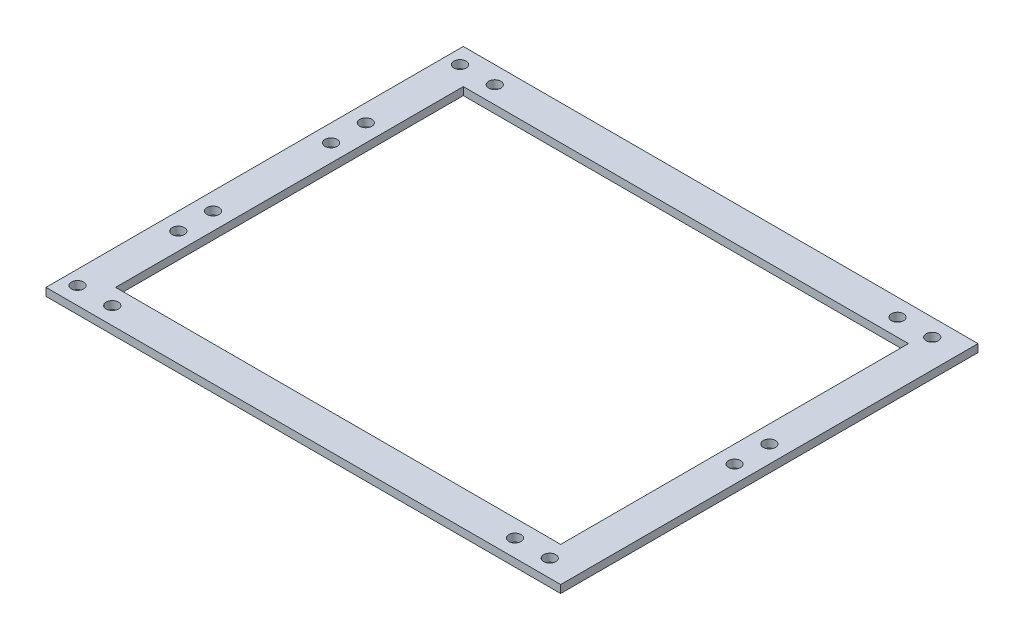
ISO-10303-21;
HEADER;
FILE_DESCRIPTION(('STEP AP214'),'2;1');
FILE_NAME('part.step','',(''),(''),'','','');
FILE_SCHEMA(('AUTOMOTIVE_DESIGN { 1 0 10303 214 1 1 1 1 }'));
ENDSEC;
DATA;
#1=APPLICATION_CONTEXT('core data for automotive mechanical design processes');
#2=APPLICATION_PROTOCOL_DEFINITION('international standard','automotive_design',2000,#1);
#3=PRODUCT_CONTEXT('',#1,'mechanical');
#4=PRODUCT('Part','Part','',(#3));
#5=PRODUCT_RELATED_PRODUCT_CATEGORY('part','',(#4));
#6=PRODUCT_DEFINITION_FORMATION('','',#4);
#7=PRODUCT_DEFINITION_CONTEXT('part definition',#1,'design');
#8=PRODUCT_DEFINITION('design','',#6,#7);
#9=PRODUCT_DEFINITION_SHAPE('','',#8);
#10=(LENGTH_UNIT() NAMED_UNIT(*) SI_UNIT(.MILLI.,.METRE.));
#11=(NAMED_UNIT(*) PLANE_ANGLE_UNIT() SI_UNIT($,.RADIAN.));
#12=(NAMED_UNIT(*) SI_UNIT($,.STERADIAN.) SOLID_ANGLE_UNIT());
#13=UNCERTAINTY_MEASURE_WITH_UNIT(LENGTH_MEASURE(1.E-05),#10,'distance_accuracy_value','');
#14=(GEOMETRIC_REPRESENTATION_CONTEXT(3) GLOBAL_UNCERTAINTY_ASSIGNED_CONTEXT((#13)) GLOBAL_UNIT_ASSIGNED_CONTEXT((#10,
#11,#12)) REPRESENTATION_CONTEXT('',''));
#15=CARTESIAN_POINT('',(0.,0.,0.));
#16=DIRECTION('',(0.,0.,1.));
#17=DIRECTION('',(1.,0.,0.));
#18=AXIS2_PLACEMENT_3D('',#15,#16,#17);
#19=CARTESIAN_POINT('',(0.,4.5,0.));
#20=DIRECTION('',(0.,-1.,0.));
#21=DIRECTION('',(0.,0.,-1.));
#22=AXIS2_PLACEMENT_3D('',#19,#20,#21);
#23=PLANE('',#22);
#24=CARTESIAN_POINT('',(-138.,4.5,-53.9240434819204));
#25=DIRECTION('',(0.,1.,0.));
#26=DIRECTION('',(0.,0.,1.));
#27=AXIS2_PLACEMENT_3D('',#24,#25,#26);
#28=CIRCLE('',#27,3.49999999999999);
#29=CARTESIAN_POINT('',(-138.,4.5,-50.4240434819204));
#30=VERTEX_POINT('',#29);
#31=EDGE_CURVE('E308',#30,#30,#28,.T.);
#32=ORIENTED_EDGE('',*,*,#31,.F.);
#33=EDGE_LOOP('',(#32));
#34=FACE_BOUND('',#33,.T.);
#35=CARTESIAN_POINT('',(-138.,4.5,-33.9240434819204));
#36=DIRECTION('',(0.,1.,0.));
#37=DIRECTION('',(0.,0.,1.));
#38=AXIS2_PLACEMENT_3D('',#35,#36,#37);
#39=CIRCLE('',#38,3.49999999999999);
#40=CARTESIAN_POINT('',(-138.,4.5,-30.4240434819204));
#41=VERTEX_POINT('',#40);
#42=EDGE_CURVE('E317',#41,#41,#39,.T.);
#43=ORIENTED_EDGE('',*,*,#42,.F.);
#44=EDGE_LOOP('',(#43));
#45=FACE_BOUND('',#44,.T.);
#46=CARTESIAN_POINT('',(-138.,4.5,33.9240434819206));
#47=DIRECTION('',(0.,1.,0.));
#48=DIRECTION('',(0.,0.,1.));
#49=AXIS2_PLACEMENT_3D('',#46,#47,#48);
#50=CIRCLE('',#49,3.49999999999999);
#51=CARTESIAN_POINT('',(-138.,4.5,37.4240434819206));
#52=VERTEX_POINT('',#51);
#53=EDGE_CURVE('E327',#52,#52,#50,.T.);
#54=ORIENTED_EDGE('',*,*,#53,.F.);
#55=EDGE_LOOP('',(#54));
#56=FACE_BOUND('',#55,.T.);
#57=CARTESIAN_POINT('',(-138.,4.5,53.9240434819206));
#58=DIRECTION('',(0.,1.,0.));
#59=DIRECTION('',(0.,0.,1.));
#60=AXIS2_PLACEMENT_3D('',#57,#58,#59);
#61=CIRCLE('',#60,3.49999999999999);
#62=CARTESIAN_POINT('',(-138.,4.5,57.4240434819206));
#63=VERTEX_POINT('',#62);
#64=EDGE_CURVE('E335',#63,#63,#61,.T.);
#65=ORIENTED_EDGE('',*,*,#64,.F.);
#66=EDGE_LOOP('',(#65));
#67=FACE_BOUND('',#66,.T.);
#68=CARTESIAN_POINT('',(138.,4.5,10.));
#69=DIRECTION('',(0.,1.,0.));
#70=DIRECTION('',(0.,0.,1.));
#71=AXIS2_PLACEMENT_3D('',#68,#69,#70);
#72=CIRCLE('',#71,3.49999999999999);
#73=CARTESIAN_POINT('',(138.,4.5,13.5));
#74=VERTEX_POINT('',#73);
#75=EDGE_CURVE('E344',#74,#74,#72,.T.);
#76=ORIENTED_EDGE('',*,*,#75,.F.);
#77=EDGE_LOOP('',(#76));
#78=FACE_BOUND('',#77,.T.);
#79=CARTESIAN_POINT('',(138.,4.5,-10.));
#80=DIRECTION('',(0.,1.,0.));
#81=DIRECTION('',(0.,0.,1.));
#82=AXIS2_PLACEMENT_3D('',#79,#80,#81);
#83=CIRCLE('',#82,3.49999999999999);
#84=CARTESIAN_POINT('',(138.,4.5,-6.50000000000002));
#85=VERTEX_POINT('',#84);
#86=EDGE_CURVE('E314',#85,#85,#83,.T.);
#87=ORIENTED_EDGE('',*,*,#86,.F.);
#88=EDGE_LOOP('',(#87));
#89=FACE_BOUND('',#88,.T.);
#90=CARTESIAN_POINT('',(111.7,4.5,-110.));
#91=DIRECTION('',(0.,-1.,0.));
#92=DIRECTION('',(0.,0.,-1.));
#93=AXIS2_PLACEMENT_3D('',#90,#91,#92);
#94=CIRCLE('',#93,3.50000000000001);
#95=CARTESIAN_POINT('',(111.7,4.5,-113.5));
#96=VERTEX_POINT('',#95);
#97=EDGE_CURVE('E360',#96,#96,#94,.T.);
#98=ORIENTED_EDGE('',*,*,#97,.T.);
#99=EDGE_LOOP('',(#98));
#100=FACE_BOUND('',#99,.T.);
#101=CARTESIAN_POINT('',(131.7,4.5,-110.));
#102=DIRECTION('',(0.,-1.,0.));
#103=DIRECTION('',(0.,0.,-1.));
#104=AXIS2_PLACEMENT_3D('',#101,#102,#103);
#105=CIRCLE('',#104,3.49999999999999);
#106=CARTESIAN_POINT('',(131.7,4.5,-113.5));
#107=VERTEX_POINT('',#106);
#108=EDGE_CURVE('E343',#107,#107,#105,.T.);
#109=ORIENTED_EDGE('',*,*,#108,.T.);
#110=EDGE_LOOP('',(#109));
#111=FACE_BOUND('',#110,.T.);
#112=CARTESIAN_POINT('',(111.7,4.5,110.));
#113=DIRECTION('',(0.,1.,0.));
#114=DIRECTION('',(0.,0.,1.));
#115=AXIS2_PLACEMENT_3D('',#112,#113,#114);
#116=CIRCLE('',#115,3.50000000000001);
#117=CARTESIAN_POINT('',(111.7,4.5,113.5));
#118=VERTEX_POINT('',#117);
#119=EDGE_CURVE('E376',#118,#118,#116,.T.);
#120=ORIENTED_EDGE('',*,*,#119,.F.);
#121=EDGE_LOOP('',(#120));
#122=FACE_BOUND('',#121,.T.);
#123=CARTESIAN_POINT('',(131.7,4.5,110.));
#124=DIRECTION('',(0.,1.,0.));
#125=DIRECTION('',(0.,0.,1.));
#126=AXIS2_PLACEMENT_3D('',#123,#124,#125);
#127=CIRCLE('',#126,3.49999999999999);
#128=CARTESIAN_POINT('',(131.7,4.5,113.5));
#129=VERTEX_POINT('',#128);
#130=EDGE_CURVE('E359',#129,#129,#127,.T.);
#131=ORIENTED_EDGE('',*,*,#130,.F.);
#132=EDGE_LOOP('',(#131));
#133=FACE_BOUND('',#132,.T.);
#134=CARTESIAN_POINT('',(-139.9,4.5,-110.));
#135=DIRECTION('',(0.,-1.,0.));
#136=DIRECTION('',(0.,0.,-1.));
#137=AXIS2_PLACEMENT_3D('',#134,#135,#136);
#138=CIRCLE('',#137,3.49999999999999);
#139=CARTESIAN_POINT('',(-139.9,4.5,-113.5));
#140=VERTEX_POINT('',#139);
#141=EDGE_CURVE('E392',#140,#140,#138,.T.);
#142=ORIENTED_EDGE('',*,*,#141,.T.);
#143=EDGE_LOOP('',(#142));
#144=FACE_BOUND('',#143,.T.);
#145=CARTESIAN_POINT('',(-119.9,4.5,-110.));
#146=DIRECTION('',(0.,-1.,0.));
#147=DIRECTION('',(0.,0.,-1.));
#148=AXIS2_PLACEMENT_3D('',#145,#146,#147);
#149=CIRCLE('',#148,3.50000000000001);
#150=CARTESIAN_POINT('',(-119.9,4.5,-113.5));
#151=VERTEX_POINT('',#150);
#152=EDGE_CURVE('E375',#151,#151,#149,.T.);
#153=ORIENTED_EDGE('',*,*,#152,.T.);
#154=EDGE_LOOP('',(#153));
#155=FACE_BOUND('',#154,.T.);
#156=CARTESIAN_POINT('',(-139.9,4.5,110.));
#157=DIRECTION('',(0.,1.,0.));
#158=DIRECTION('',(0.,0.,1.));
#159=AXIS2_PLACEMENT_3D('',#156,#157,#158);
#160=CIRCLE('',#159,3.49999999999999);
#161=CARTESIAN_POINT('',(-139.9,4.5,113.5));
#162=VERTEX_POINT('',#161);
#163=EDGE_CURVE('E406',#162,#162,#160,.T.);
#164=ORIENTED_EDGE('',*,*,#163,.F.);
#165=EDGE_LOOP('',(#164));
#166=FACE_BOUND('',#165,.T.);
#167=CARTESIAN_POINT('',(-119.9,4.5,110.));
#168=DIRECTION('',(0.,1.,0.));
#169=DIRECTION('',(0.,0.,1.));
#170=AXIS2_PLACEMENT_3D('',#167,#168,#169);
#171=CIRCLE('',#170,3.50000000000001);
#172=CARTESIAN_POINT('',(-119.9,4.5,113.5));
#173=VERTEX_POINT('',#172);
#174=EDGE_CURVE('E391',#173,#173,#171,.T.);
#175=ORIENTED_EDGE('',*,*,#174,.F.);
#176=EDGE_LOOP('',(#175));
#177=FACE_BOUND('',#176,.T.);
#178=DIRECTION('',(0.,0.,-1.));
#179=VECTOR('',#178,1.);
#180=CARTESIAN_POINT('',(148.,4.5,120.));
#181=LINE('',#180,#179);
#182=CARTESIAN_POINT('',(148.,4.5,120.));
#183=VERTEX_POINT('',#182);
#184=CARTESIAN_POINT('',(148.,4.5,-120.));
#185=VERTEX_POINT('',#184);
#186=EDGE_CURVE('E154',#183,#185,#181,.T.);
#187=ORIENTED_EDGE('',*,*,#186,.T.);
#188=DIRECTION('',(-1.,0.,0.));
#189=VECTOR('',#188,1.);
#190=CARTESIAN_POINT('',(-148.,4.5,-120.));
#191=LINE('',#190,#189);
#192=CARTESIAN_POINT('',(-148.,4.5,-120.));
#193=VERTEX_POINT('',#192);
#194=EDGE_CURVE('E158',#185,#193,#191,.T.);
#195=ORIENTED_EDGE('',*,*,#194,.T.);
#196=DIRECTION('',(0.,0.,1.));
#197=VECTOR('',#196,1.);
#198=CARTESIAN_POINT('',(-148.,4.5,120.));
#199=LINE('',#198,#197);
#200=CARTESIAN_POINT('',(-148.,4.5,120.));
#201=VERTEX_POINT('',#200);
#202=EDGE_CURVE('E162',#193,#201,#199,.T.);
#203=ORIENTED_EDGE('',*,*,#202,.T.);
#204=DIRECTION('',(1.,0.,0.));
#205=VECTOR('',#204,1.);
#206=CARTESIAN_POINT('',(-148.,4.5,120.));
#207=LINE('',#206,#205);
#208=EDGE_CURVE('E165',#201,#183,#207,.T.);
#209=ORIENTED_EDGE('',*,*,#208,.T.);
#210=EDGE_LOOP('',(#187,#195,#203,#209));
#211=FACE_BOUND('',#210,.T.);
#212=DIRECTION('',(0.,0.,1.));
#213=VECTOR('',#212,1.);
#214=CARTESIAN_POINT('',(-128.,4.5,-100.));
#215=LINE('',#214,#213);
#216=CARTESIAN_POINT('',(-128.,4.5,-100.));
#217=VERTEX_POINT('',#216);
#218=CARTESIAN_POINT('',(-128.,4.5,100.));
#219=VERTEX_POINT('',#218);
#220=EDGE_CURVE('E104',#217,#219,#215,.T.);
#221=ORIENTED_EDGE('',*,*,#220,.F.);
#222=DIRECTION('',(-1.,0.,0.));
#223=VECTOR('',#222,1.);
#224=CARTESIAN_POINT('',(-128.,4.5,-100.));
#225=LINE('',#224,#223);
#226=CARTESIAN_POINT('',(128.,4.5,-100.));
#227=VERTEX_POINT('',#226);
#228=EDGE_CURVE('E130',#227,#217,#225,.T.);
#229=ORIENTED_EDGE('',*,*,#228,.F.);
#230=DIRECTION('',(0.,0.,-1.));
#231=VECTOR('',#230,1.);
#232=CARTESIAN_POINT('',(128.,4.5,-100.));
#233=LINE('',#232,#231);
#234=CARTESIAN_POINT('',(128.,4.5,100.));
#235=VERTEX_POINT('',#234);
#236=EDGE_CURVE('E126',#235,#227,#233,.T.);
#237=ORIENTED_EDGE('',*,*,#236,.F.);
#238=DIRECTION('',(1.,0.,0.));
#239=VECTOR('',#238,1.);
#240=CARTESIAN_POINT('',(-128.,4.5,100.));
#241=LINE('',#240,#239);
#242=EDGE_CURVE('E113',#219,#235,#241,.T.);
#243=ORIENTED_EDGE('',*,*,#242,.F.);
#244=EDGE_LOOP('',(#221,#229,#237,#243));
#245=FACE_BOUND('',#244,.T.);
#246=ADVANCED_FACE('F38',(#34,#45,#56,#67,#78,#89,#100,#111,#122,#133,#144,#155,#166,#177,#211,
#245),#23,.F.);
#247=CARTESIAN_POINT('',(0.,0.,0.));
#248=DIRECTION('',(0.,-1.,0.));
#249=DIRECTION('',(0.,0.,-1.));
#250=AXIS2_PLACEMENT_3D('',#247,#248,#249);
#251=PLANE('',#250);
#252=CARTESIAN_POINT('',(-138.,0.,-53.9240434819204));
#253=DIRECTION('',(0.,1.,0.));
#254=DIRECTION('',(0.,0.,1.));
#255=AXIS2_PLACEMENT_3D('',#252,#253,#254);
#256=CIRCLE('',#255,3.49999999999999);
#257=CARTESIAN_POINT('',(-138.,0.,-50.4240434819204));
#258=VERTEX_POINT('',#257);
#259=EDGE_CURVE('E306',#258,#258,#256,.T.);
#260=ORIENTED_EDGE('',*,*,#259,.T.);
#261=EDGE_LOOP('',(#260));
#262=FACE_BOUND('',#261,.T.);
#263=CARTESIAN_POINT('',(-138.,0.,-33.9240434819204));
#264=DIRECTION('',(0.,1.,0.));
#265=DIRECTION('',(0.,0.,1.));
#266=AXIS2_PLACEMENT_3D('',#263,#264,#265);
#267=CIRCLE('',#266,3.49999999999999);
#268=CARTESIAN_POINT('',(-138.,0.,-30.4240434819204));
#269=VERTEX_POINT('',#268);
#270=EDGE_CURVE('E310',#269,#269,#267,.T.);
#271=ORIENTED_EDGE('',*,*,#270,.T.);
#272=EDGE_LOOP('',(#271));
#273=FACE_BOUND('',#272,.T.);
#274=CARTESIAN_POINT('',(-138.,0.,33.9240434819206));
#275=DIRECTION('',(0.,1.,0.));
#276=DIRECTION('',(0.,0.,1.));
#277=AXIS2_PLACEMENT_3D('',#274,#275,#276);
#278=CIRCLE('',#277,3.49999999999999);
#279=CARTESIAN_POINT('',(-138.,0.,37.4240434819206));
#280=VERTEX_POINT('',#279);
#281=EDGE_CURVE('E323',#280,#280,#278,.T.);
#282=ORIENTED_EDGE('',*,*,#281,.T.);
#283=EDGE_LOOP('',(#282));
#284=FACE_BOUND('',#283,.T.);
#285=CARTESIAN_POINT('',(-138.,0.,53.9240434819206));
#286=DIRECTION('',(0.,1.,0.));
#287=DIRECTION('',(0.,0.,1.));
#288=AXIS2_PLACEMENT_3D('',#285,#286,#287);
#289=CIRCLE('',#288,3.49999999999999);
#290=CARTESIAN_POINT('',(-138.,0.,57.4240434819206));
#291=VERTEX_POINT('',#290);
#292=EDGE_CURVE('E331',#291,#291,#289,.T.);
#293=ORIENTED_EDGE('',*,*,#292,.T.);
#294=EDGE_LOOP('',(#293));
#295=FACE_BOUND('',#294,.T.);
#296=CARTESIAN_POINT('',(138.,0.,10.));
#297=DIRECTION('',(0.,1.,0.));
#298=DIRECTION('',(0.,0.,1.));
#299=AXIS2_PLACEMENT_3D('',#296,#297,#298);
#300=CIRCLE('',#299,3.49999999999999);
#301=CARTESIAN_POINT('',(138.,0.,13.5));
#302=VERTEX_POINT('',#301);
#303=EDGE_CURVE('E339',#302,#302,#300,.T.);
#304=ORIENTED_EDGE('',*,*,#303,.T.);
#305=EDGE_LOOP('',(#304));
#306=FACE_BOUND('',#305,.T.);
#307=CARTESIAN_POINT('',(138.,0.,-10.));
#308=DIRECTION('',(0.,1.,0.));
#309=DIRECTION('',(0.,0.,1.));
#310=AXIS2_PLACEMENT_3D('',#307,#308,#309);
#311=CIRCLE('',#310,3.49999999999999);
#312=CARTESIAN_POINT('',(138.,0.,-6.50000000000002));
#313=VERTEX_POINT('',#312);
#314=EDGE_CURVE('E348',#313,#313,#311,.T.);
#315=ORIENTED_EDGE('',*,*,#314,.T.);
#316=EDGE_LOOP('',(#315));
#317=FACE_BOUND('',#316,.T.);
#318=CARTESIAN_POINT('',(111.7,0.,-110.));
#319=DIRECTION('',(0.,-1.,0.));
#320=DIRECTION('',(0.,0.,-1.));
#321=AXIS2_PLACEMENT_3D('',#318,#319,#320);
#322=CIRCLE('',#321,3.50000000000001);
#323=CARTESIAN_POINT('',(111.7,0.,-113.5));
#324=VERTEX_POINT('',#323);
#325=EDGE_CURVE('E355',#324,#324,#322,.T.);
#326=ORIENTED_EDGE('',*,*,#325,.F.);
#327=EDGE_LOOP('',(#326));
#328=FACE_BOUND('',#327,.T.);
#329=CARTESIAN_POINT('',(131.7,0.,-110.));
#330=DIRECTION('',(0.,-1.,0.));
#331=DIRECTION('',(0.,0.,-1.));
#332=AXIS2_PLACEMENT_3D('',#329,#330,#331);
#333=CIRCLE('',#332,3.49999999999999);
#334=CARTESIAN_POINT('',(131.7,0.,-113.5));
#335=VERTEX_POINT('',#334);
#336=EDGE_CURVE('E364',#335,#335,#333,.T.);
#337=ORIENTED_EDGE('',*,*,#336,.F.);
#338=EDGE_LOOP('',(#337));
#339=FACE_BOUND('',#338,.T.);
#340=CARTESIAN_POINT('',(111.7,0.,110.));
#341=DIRECTION('',(0.,1.,0.));
#342=DIRECTION('',(0.,0.,1.));
#343=AXIS2_PLACEMENT_3D('',#340,#341,#342);
#344=CIRCLE('',#343,3.50000000000001);
#345=CARTESIAN_POINT('',(111.7,0.,113.5));
#346=VERTEX_POINT('',#345);
#347=EDGE_CURVE('E371',#346,#346,#344,.T.);
#348=ORIENTED_EDGE('',*,*,#347,.T.);
#349=EDGE_LOOP('',(#348));
#350=FACE_BOUND('',#349,.T.);
#351=CARTESIAN_POINT('',(131.7,0.,110.));
#352=DIRECTION('',(0.,1.,0.));
#353=DIRECTION('',(0.,0.,1.));
#354=AXIS2_PLACEMENT_3D('',#351,#352,#353);
#355=CIRCLE('',#354,3.49999999999999);
#356=CARTESIAN_POINT('',(131.7,0.,113.5));
#357=VERTEX_POINT('',#356);
#358=EDGE_CURVE('E380',#357,#357,#355,.T.);
#359=ORIENTED_EDGE('',*,*,#358,.T.);
#360=EDGE_LOOP('',(#359));
#361=FACE_BOUND('',#360,.T.);
#362=CARTESIAN_POINT('',(-139.9,0.,-110.));
#363=DIRECTION('',(0.,-1.,0.));
#364=DIRECTION('',(0.,0.,-1.));
#365=AXIS2_PLACEMENT_3D('',#362,#363,#364);
#366=CIRCLE('',#365,3.49999999999999);
#367=CARTESIAN_POINT('',(-139.9,0.,-113.5));
#368=VERTEX_POINT('',#367);
#369=EDGE_CURVE('E387',#368,#368,#366,.T.);
#370=ORIENTED_EDGE('',*,*,#369,.F.);
#371=EDGE_LOOP('',(#370));
#372=FACE_BOUND('',#371,.T.);
#373=CARTESIAN_POINT('',(-119.9,0.,-110.));
#374=DIRECTION('',(0.,-1.,0.));
#375=DIRECTION('',(0.,0.,-1.));
#376=AXIS2_PLACEMENT_3D('',#373,#374,#375);
#377=CIRCLE('',#376,3.50000000000001);
#378=CARTESIAN_POINT('',(-119.9,0.,-113.5));
#379=VERTEX_POINT('',#378);
#380=EDGE_CURVE('E396',#379,#379,#377,.T.);
#381=ORIENTED_EDGE('',*,*,#380,.F.);
#382=EDGE_LOOP('',(#381));
#383=FACE_BOUND('',#382,.T.);
#384=CARTESIAN_POINT('',(-139.9,0.,110.));
#385=DIRECTION('',(0.,1.,0.));
#386=DIRECTION('',(0.,0.,1.));
#387=AXIS2_PLACEMENT_3D('',#384,#385,#386);
#388=CIRCLE('',#387,3.49999999999999);
#389=CARTESIAN_POINT('',(-139.9,0.,113.5));
#390=VERTEX_POINT('',#389);
#391=EDGE_CURVE('E138',#390,#390,#388,.T.);
#392=ORIENTED_EDGE('',*,*,#391,.T.);
#393=EDGE_LOOP('',(#392));
#394=FACE_BOUND('',#393,.T.);
#395=CARTESIAN_POINT('',(-119.9,0.,110.));
#396=DIRECTION('',(0.,1.,0.));
#397=DIRECTION('',(0.,0.,1.));
#398=AXIS2_PLACEMENT_3D('',#395,#396,#397);
#399=CIRCLE('',#398,3.50000000000001);
#400=CARTESIAN_POINT('',(-119.9,0.,113.5));
#401=VERTEX_POINT('',#400);
#402=EDGE_CURVE('E410',#401,#401,#399,.T.);
#403=ORIENTED_EDGE('',*,*,#402,.T.);
#404=EDGE_LOOP('',(#403));
#405=FACE_BOUND('',#404,.T.);
#406=DIRECTION('',(0.,0.,-1.));
#407=VECTOR('',#406,1.);
#408=CARTESIAN_POINT('',(148.,0.,120.));
#409=LINE('',#408,#407);
#410=CARTESIAN_POINT('',(148.,0.,120.));
#411=VERTEX_POINT('',#410);
#412=CARTESIAN_POINT('',(148.,0.,-120.));
#413=VERTEX_POINT('',#412);
#414=EDGE_CURVE('E122',#411,#413,#409,.T.);
#415=ORIENTED_EDGE('',*,*,#414,.F.);
#416=DIRECTION('',(1.,0.,0.));
#417=VECTOR('',#416,1.);
#418=CARTESIAN_POINT('',(-148.,0.,120.));
#419=LINE('',#418,#417);
#420=CARTESIAN_POINT('',(-148.,0.,120.));
#421=VERTEX_POINT('',#420);
#422=EDGE_CURVE('E159',#421,#411,#419,.T.);
#423=ORIENTED_EDGE('',*,*,#422,.F.);
#424=DIRECTION('',(0.,0.,1.));
#425=VECTOR('',#424,1.);
#426=CARTESIAN_POINT('',(-148.,0.,120.));
#427=LINE('',#426,#425);
#428=CARTESIAN_POINT('',(-148.,0.,-120.));
#429=VERTEX_POINT('',#428);
#430=EDGE_CURVE('E175',#429,#421,#427,.T.);
#431=ORIENTED_EDGE('',*,*,#430,.F.);
#432=DIRECTION('',(-1.,0.,0.));
#433=VECTOR('',#432,1.);
#434=CARTESIAN_POINT('',(-148.,0.,-120.));
#435=LINE('',#434,#433);
#436=EDGE_CURVE('E172',#413,#429,#435,.T.);
#437=ORIENTED_EDGE('',*,*,#436,.F.);
#438=EDGE_LOOP('',(#415,#423,#431,#437));
#439=FACE_BOUND('',#438,.T.);
#440=DIRECTION('',(-1.,0.,0.));
#441=VECTOR('',#440,1.);
#442=CARTESIAN_POINT('',(-128.,0.,-100.));
#443=LINE('',#442,#441);
#444=CARTESIAN_POINT('',(128.,0.,-100.));
#445=VERTEX_POINT('',#444);
#446=CARTESIAN_POINT('',(-128.,0.,-100.));
#447=VERTEX_POINT('',#446);
#448=EDGE_CURVE('E114',#445,#447,#443,.T.);
#449=ORIENTED_EDGE('',*,*,#448,.T.);
#450=DIRECTION('',(0.,0.,1.));
#451=VECTOR('',#450,1.);
#452=CARTESIAN_POINT('',(-128.,0.,-100.));
#453=LINE('',#452,#451);
#454=CARTESIAN_POINT('',(-128.,0.,100.));
#455=VERTEX_POINT('',#454);
#456=EDGE_CURVE('E62',#447,#455,#453,.T.);
#457=ORIENTED_EDGE('',*,*,#456,.T.);
#458=DIRECTION('',(1.,0.,0.));
#459=VECTOR('',#458,1.);
#460=CARTESIAN_POINT('',(-128.,0.,100.));
#461=LINE('',#460,#459);
#462=CARTESIAN_POINT('',(128.,0.,100.));
#463=VERTEX_POINT('',#462);
#464=EDGE_CURVE('E120',#455,#463,#461,.T.);
#465=ORIENTED_EDGE('',*,*,#464,.T.);
#466=DIRECTION('',(0.,0.,-1.));
#467=VECTOR('',#466,1.);
#468=CARTESIAN_POINT('',(128.,0.,-100.));
#469=LINE('',#468,#467);
#470=EDGE_CURVE('E141',#463,#445,#469,.T.);
#471=ORIENTED_EDGE('',*,*,#470,.T.);
#472=EDGE_LOOP('',(#449,#457,#465,#471));
#473=FACE_BOUND('',#472,.T.);
#474=ADVANCED_FACE('F198',(#262,#273,#284,#295,#306,#317,#328,#339,#350,#361,#372,#383,#394,
#405,#439,#473),#251,.T.);
#475=CARTESIAN_POINT('',(148.,4.5,120.));
#476=DIRECTION('',(-1.,0.,0.));
#477=DIRECTION('',(0.,0.,1.));
#478=AXIS2_PLACEMENT_3D('',#475,#476,#477);
#479=PLANE('',#478);
#480=ORIENTED_EDGE('',*,*,#414,.T.);
#481=DIRECTION('',(0.,-1.,0.));
#482=VECTOR('',#481,1.);
#483=CARTESIAN_POINT('',(148.,4.5,-120.));
#484=LINE('',#483,#482);
#485=EDGE_CURVE('E11',#185,#413,#484,.T.);
#486=ORIENTED_EDGE('',*,*,#485,.F.);
#487=ORIENTED_EDGE('',*,*,#186,.F.);
#488=DIRECTION('',(0.,-1.,0.));
#489=VECTOR('',#488,1.);
#490=CARTESIAN_POINT('',(148.,4.5,120.));
#491=LINE('',#490,#489);
#492=EDGE_CURVE('E168',#183,#411,#491,.T.);
#493=ORIENTED_EDGE('',*,*,#492,.T.);
#494=EDGE_LOOP('',(#480,#486,#487,#493));
#495=FACE_BOUND('',#494,.T.);
#496=ADVANCED_FACE('F40',(#495),#479,.F.);
#497=CARTESIAN_POINT('',(-148.,4.5,-120.));
#498=DIRECTION('',(0.,0.,1.));
#499=DIRECTION('',(1.,0.,0.));
#500=AXIS2_PLACEMENT_3D('',#497,#498,#499);
#501=PLANE('',#500);
#502=ORIENTED_EDGE('',*,*,#436,.T.);
#503=DIRECTION('',(0.,-1.,0.));
#504=VECTOR('',#503,1.);
#505=CARTESIAN_POINT('',(-148.,4.5,-120.));
#506=LINE('',#505,#504);
#507=EDGE_CURVE('E47',#193,#429,#506,.T.);
#508=ORIENTED_EDGE('',*,*,#507,.F.);
#509=ORIENTED_EDGE('',*,*,#194,.F.);
#510=ORIENTED_EDGE('',*,*,#485,.T.);
#511=EDGE_LOOP('',(#502,#508,#509,#510));
#512=FACE_BOUND('',#511,.T.);
#513=ADVANCED_FACE('F208',(#512),#501,.F.);
#514=CARTESIAN_POINT('',(-148.,4.5,120.));
#515=DIRECTION('',(1.,0.,0.));
#516=DIRECTION('',(0.,0.,-1.));
#517=AXIS2_PLACEMENT_3D('',#514,#515,#516);
#518=PLANE('',#517);
#519=ORIENTED_EDGE('',*,*,#430,.T.);
#520=DIRECTION('',(0.,-1.,0.));
#521=VECTOR('',#520,1.);
#522=CARTESIAN_POINT('',(-148.,4.5,120.));
#523=LINE('',#522,#521);
#524=EDGE_CURVE('E183',#201,#421,#523,.T.);
#525=ORIENTED_EDGE('',*,*,#524,.F.);
#526=ORIENTED_EDGE('',*,*,#202,.F.);
#527=ORIENTED_EDGE('',*,*,#507,.T.);
#528=EDGE_LOOP('',(#519,#525,#526,#527));
#529=FACE_BOUND('',#528,.T.);
#530=ADVANCED_FACE('F192',(#529),#518,.F.);
#531=CARTESIAN_POINT('',(-148.,4.5,120.));
#532=DIRECTION('',(0.,0.,-1.));
#533=DIRECTION('',(-1.,0.,0.));
#534=AXIS2_PLACEMENT_3D('',#531,#532,#533);
#535=PLANE('',#534);
#536=ORIENTED_EDGE('',*,*,#422,.T.);
#537=ORIENTED_EDGE('',*,*,#492,.F.);
#538=ORIENTED_EDGE('',*,*,#208,.F.);
#539=ORIENTED_EDGE('',*,*,#524,.T.);
#540=EDGE_LOOP('',(#536,#537,#538,#539));
#541=FACE_BOUND('',#540,.T.);
#542=ADVANCED_FACE('F202',(#541),#535,.F.);
#543=CARTESIAN_POINT('',(-128.,4.5,-100.));
#544=DIRECTION('',(1.,0.,0.));
#545=DIRECTION('',(0.,0.,-1.));
#546=AXIS2_PLACEMENT_3D('',#543,#544,#545);
#547=PLANE('',#546);
#548=ORIENTED_EDGE('',*,*,#456,.F.);
#549=DIRECTION('',(0.,-1.,0.));
#550=VECTOR('',#549,1.);
#551=CARTESIAN_POINT('',(-128.,4.5,-100.));
#552=LINE('',#551,#550);
#553=EDGE_CURVE('E108',#217,#447,#552,.T.);
#554=ORIENTED_EDGE('',*,*,#553,.F.);
#555=ORIENTED_EDGE('',*,*,#220,.T.);
#556=DIRECTION('',(0.,-1.,0.));
#557=VECTOR('',#556,1.);
#558=CARTESIAN_POINT('',(-128.,4.5,100.));
#559=LINE('',#558,#557);
#560=EDGE_CURVE('E107',#219,#455,#559,.T.);
#561=ORIENTED_EDGE('',*,*,#560,.T.);
#562=EDGE_LOOP('',(#548,#554,#555,#561));
#563=FACE_BOUND('',#562,.T.);
#564=ADVANCED_FACE('F106',(#563),#547,.T.);
#565=CARTESIAN_POINT('',(-128.,4.5,100.));
#566=DIRECTION('',(0.,0.,-1.));
#567=DIRECTION('',(-1.,0.,0.));
#568=AXIS2_PLACEMENT_3D('',#565,#566,#567);
#569=PLANE('',#568);
#570=ORIENTED_EDGE('',*,*,#464,.F.);
#571=ORIENTED_EDGE('',*,*,#560,.F.);
#572=ORIENTED_EDGE('',*,*,#242,.T.);
#573=DIRECTION('',(0.,-1.,0.));
#574=VECTOR('',#573,1.);
#575=CARTESIAN_POINT('',(128.,4.5,100.));
#576=LINE('',#575,#574);
#577=EDGE_CURVE('E123',#235,#463,#576,.T.);
#578=ORIENTED_EDGE('',*,*,#577,.T.);
#579=EDGE_LOOP('',(#570,#571,#572,#578));
#580=FACE_BOUND('',#579,.T.);
#581=ADVANCED_FACE('F117',(#580),#569,.T.);
#582=CARTESIAN_POINT('',(128.,4.5,-100.));
#583=DIRECTION('',(-1.,0.,0.));
#584=DIRECTION('',(0.,0.,1.));
#585=AXIS2_PLACEMENT_3D('',#582,#583,#584);
#586=PLANE('',#585);
#587=ORIENTED_EDGE('',*,*,#470,.F.);
#588=ORIENTED_EDGE('',*,*,#577,.F.);
#589=ORIENTED_EDGE('',*,*,#236,.T.);
#590=DIRECTION('',(0.,-1.,0.));
#591=VECTOR('',#590,1.);
#592=CARTESIAN_POINT('',(128.,4.5,-100.));
#593=LINE('',#592,#591);
#594=EDGE_CURVE('E54',#227,#445,#593,.T.);
#595=ORIENTED_EDGE('',*,*,#594,.T.);
#596=EDGE_LOOP('',(#587,#588,#589,#595));
#597=FACE_BOUND('',#596,.T.);
#598=ADVANCED_FACE('F236',(#597),#586,.T.);
#599=CARTESIAN_POINT('',(-128.,4.5,-100.));
#600=DIRECTION('',(0.,0.,1.));
#601=DIRECTION('',(1.,0.,0.));
#602=AXIS2_PLACEMENT_3D('',#599,#600,#601);
#603=PLANE('',#602);
#604=ORIENTED_EDGE('',*,*,#448,.F.);
#605=ORIENTED_EDGE('',*,*,#594,.F.);
#606=ORIENTED_EDGE('',*,*,#228,.T.);
#607=ORIENTED_EDGE('',*,*,#553,.T.);
#608=EDGE_LOOP('',(#604,#605,#606,#607));
#609=FACE_BOUND('',#608,.T.);
#610=ADVANCED_FACE('F240',(#609),#603,.T.);
#611=CARTESIAN_POINT('',(-119.9,0.,110.));
#612=DIRECTION('',(0.,1.,0.));
#613=DIRECTION('',(0.,0.,1.));
#614=AXIS2_PLACEMENT_3D('',#611,#612,#613);
#615=CYLINDRICAL_SURFACE('',#614,3.50000000000001);
#616=ORIENTED_EDGE('',*,*,#402,.F.);
#617=EDGE_LOOP('',(#616));
#618=FACE_BOUND('',#617,.T.);
#619=ORIENTED_EDGE('',*,*,#174,.T.);
#620=EDGE_LOOP('',(#619));
#621=FACE_BOUND('',#620,.T.);
#622=ADVANCED_FACE('F246',(#618,#621),#615,.F.);
#623=CARTESIAN_POINT('',(-139.9,0.,110.));
#624=DIRECTION('',(0.,1.,0.));
#625=DIRECTION('',(0.,0.,1.));
#626=AXIS2_PLACEMENT_3D('',#623,#624,#625);
#627=CYLINDRICAL_SURFACE('',#626,3.49999999999999);
#628=ORIENTED_EDGE('',*,*,#391,.F.);
#629=EDGE_LOOP('',(#628));
#630=FACE_BOUND('',#629,.T.);
#631=ORIENTED_EDGE('',*,*,#163,.T.);
#632=EDGE_LOOP('',(#631));
#633=FACE_BOUND('',#632,.T.);
#634=ADVANCED_FACE('F249',(#630,#633),#627,.F.);
#635=CARTESIAN_POINT('',(-119.9,0.,-110.));
#636=DIRECTION('',(0.,1.,0.));
#637=DIRECTION('',(0.,0.,1.));
#638=AXIS2_PLACEMENT_3D('',#635,#636,#637);
#639=CYLINDRICAL_SURFACE('',#638,3.50000000000001);
#640=ORIENTED_EDGE('',*,*,#380,.T.);
#641=EDGE_LOOP('',(#640));
#642=FACE_BOUND('',#641,.T.);
#643=ORIENTED_EDGE('',*,*,#152,.F.);
#644=EDGE_LOOP('',(#643));
#645=FACE_BOUND('',#644,.T.);
#646=ADVANCED_FACE('F253',(#642,#645),#639,.F.);
#647=CARTESIAN_POINT('',(-139.9,0.,-110.));
#648=DIRECTION('',(0.,1.,0.));
#649=DIRECTION('',(0.,0.,1.));
#650=AXIS2_PLACEMENT_3D('',#647,#648,#649);
#651=CYLINDRICAL_SURFACE('',#650,3.49999999999999);
#652=ORIENTED_EDGE('',*,*,#369,.T.);
#653=EDGE_LOOP('',(#652));
#654=FACE_BOUND('',#653,.T.);
#655=ORIENTED_EDGE('',*,*,#141,.F.);
#656=EDGE_LOOP('',(#655));
#657=FACE_BOUND('',#656,.T.);
#658=ADVANCED_FACE('F257',(#654,#657),#651,.F.);
#659=CARTESIAN_POINT('',(131.7,0.,110.));
#660=DIRECTION('',(0.,1.,0.));
#661=DIRECTION('',(0.,0.,1.));
#662=AXIS2_PLACEMENT_3D('',#659,#660,#661);
#663=CYLINDRICAL_SURFACE('',#662,3.49999999999999);
#664=ORIENTED_EDGE('',*,*,#358,.F.);
#665=EDGE_LOOP('',(#664));
#666=FACE_BOUND('',#665,.T.);
#667=ORIENTED_EDGE('',*,*,#130,.T.);
#668=EDGE_LOOP('',(#667));
#669=FACE_BOUND('',#668,.T.);
#670=ADVANCED_FACE('F261',(#666,#669),#663,.F.);
#671=CARTESIAN_POINT('',(111.7,0.,110.));
#672=DIRECTION('',(0.,1.,0.));
#673=DIRECTION('',(0.,0.,1.));
#674=AXIS2_PLACEMENT_3D('',#671,#672,#673);
#675=CYLINDRICAL_SURFACE('',#674,3.50000000000001);
#676=ORIENTED_EDGE('',*,*,#347,.F.);
#677=EDGE_LOOP('',(#676));
#678=FACE_BOUND('',#677,.T.);
#679=ORIENTED_EDGE('',*,*,#119,.T.);
#680=EDGE_LOOP('',(#679));
#681=FACE_BOUND('',#680,.T.);
#682=ADVANCED_FACE('F265',(#678,#681),#675,.F.);
#683=CARTESIAN_POINT('',(131.7,0.,-110.));
#684=DIRECTION('',(0.,1.,0.));
#685=DIRECTION('',(0.,0.,1.));
#686=AXIS2_PLACEMENT_3D('',#683,#684,#685);
#687=CYLINDRICAL_SURFACE('',#686,3.49999999999999);
#688=ORIENTED_EDGE('',*,*,#336,.T.);
#689=EDGE_LOOP('',(#688));
#690=FACE_BOUND('',#689,.T.);
#691=ORIENTED_EDGE('',*,*,#108,.F.);
#692=EDGE_LOOP('',(#691));
#693=FACE_BOUND('',#692,.T.);
#694=ADVANCED_FACE('F269',(#690,#693),#687,.F.);
#695=CARTESIAN_POINT('',(111.7,0.,-110.));
#696=DIRECTION('',(0.,1.,0.));
#697=DIRECTION('',(0.,0.,1.));
#698=AXIS2_PLACEMENT_3D('',#695,#696,#697);
#699=CYLINDRICAL_SURFACE('',#698,3.50000000000001);
#700=ORIENTED_EDGE('',*,*,#325,.T.);
#701=EDGE_LOOP('',(#700));
#702=FACE_BOUND('',#701,.T.);
#703=ORIENTED_EDGE('',*,*,#97,.F.);
#704=EDGE_LOOP('',(#703));
#705=FACE_BOUND('',#704,.T.);
#706=ADVANCED_FACE('F273',(#702,#705),#699,.F.);
#707=CARTESIAN_POINT('',(138.,0.,-10.));
#708=DIRECTION('',(0.,1.,0.));
#709=DIRECTION('',(0.,0.,1.));
#710=AXIS2_PLACEMENT_3D('',#707,#708,#709);
#711=CYLINDRICAL_SURFACE('',#710,3.49999999999999);
#712=ORIENTED_EDGE('',*,*,#314,.F.);
#713=EDGE_LOOP('',(#712));
#714=FACE_BOUND('',#713,.T.);
#715=ORIENTED_EDGE('',*,*,#86,.T.);
#716=EDGE_LOOP('',(#715));
#717=FACE_BOUND('',#716,.T.);
#718=ADVANCED_FACE('F277',(#714,#717),#711,.F.);
#719=CARTESIAN_POINT('',(138.,0.,10.));
#720=DIRECTION('',(0.,1.,0.));
#721=DIRECTION('',(0.,0.,1.));
#722=AXIS2_PLACEMENT_3D('',#719,#720,#721);
#723=CYLINDRICAL_SURFACE('',#722,3.49999999999999);
#724=ORIENTED_EDGE('',*,*,#303,.F.);
#725=EDGE_LOOP('',(#724));
#726=FACE_BOUND('',#725,.T.);
#727=ORIENTED_EDGE('',*,*,#75,.T.);
#728=EDGE_LOOP('',(#727));
#729=FACE_BOUND('',#728,.T.);
#730=ADVANCED_FACE('F281',(#726,#729),#723,.F.);
#731=CARTESIAN_POINT('',(-138.,0.,53.9240434819206));
#732=DIRECTION('',(0.,1.,0.));
#733=DIRECTION('',(0.,0.,1.));
#734=AXIS2_PLACEMENT_3D('',#731,#732,#733);
#735=CYLINDRICAL_SURFACE('',#734,3.49999999999999);
#736=ORIENTED_EDGE('',*,*,#292,.F.);
#737=EDGE_LOOP('',(#736));
#738=FACE_BOUND('',#737,.T.);
#739=ORIENTED_EDGE('',*,*,#64,.T.);
#740=EDGE_LOOP('',(#739));
#741=FACE_BOUND('',#740,.T.);
#742=ADVANCED_FACE('F285',(#738,#741),#735,.F.);
#743=CARTESIAN_POINT('',(-138.,0.,33.9240434819206));
#744=DIRECTION('',(0.,1.,0.));
#745=DIRECTION('',(0.,0.,1.));
#746=AXIS2_PLACEMENT_3D('',#743,#744,#745);
#747=CYLINDRICAL_SURFACE('',#746,3.49999999999999);
#748=ORIENTED_EDGE('',*,*,#281,.F.);
#749=EDGE_LOOP('',(#748));
#750=FACE_BOUND('',#749,.T.);
#751=ORIENTED_EDGE('',*,*,#53,.T.);
#752=EDGE_LOOP('',(#751));
#753=FACE_BOUND('',#752,.T.);
#754=ADVANCED_FACE('F289',(#750,#753),#747,.F.);
#755=CARTESIAN_POINT('',(-138.,0.,-33.9240434819204));
#756=DIRECTION('',(0.,1.,0.));
#757=DIRECTION('',(0.,0.,1.));
#758=AXIS2_PLACEMENT_3D('',#755,#756,#757);
#759=CYLINDRICAL_SURFACE('',#758,3.49999999999999);
#760=ORIENTED_EDGE('',*,*,#270,.F.);
#761=EDGE_LOOP('',(#760));
#762=FACE_BOUND('',#761,.T.);
#763=ORIENTED_EDGE('',*,*,#42,.T.);
#764=EDGE_LOOP('',(#763));
#765=FACE_BOUND('',#764,.T.);
#766=ADVANCED_FACE('F293',(#762,#765),#759,.F.);
#767=CARTESIAN_POINT('',(-138.,0.,-53.9240434819204));
#768=DIRECTION('',(0.,1.,0.));
#769=DIRECTION('',(0.,0.,1.));
#770=AXIS2_PLACEMENT_3D('',#767,#768,#769);
#771=CYLINDRICAL_SURFACE('',#770,3.49999999999999);
#772=ORIENTED_EDGE('',*,*,#259,.F.);
#773=EDGE_LOOP('',(#772));
#774=FACE_BOUND('',#773,.T.);
#775=ORIENTED_EDGE('',*,*,#31,.T.);
#776=EDGE_LOOP('',(#775));
#777=FACE_BOUND('',#776,.T.);
#778=ADVANCED_FACE('F297',(#774,#777),#771,.F.);
#779=CLOSED_SHELL('',(#246,#474,#496,#513,#530,#542,#564,#581,#598,#610,#622,#634,#646,#658,
#670,#682,#694,#706,#718,#730,#742,#754,#766,#778));
#780=MANIFOLD_SOLID_BREP('B2',#779);
#781=ADVANCED_BREP_SHAPE_REPRESENTATION('',(#18,#780),#14);
#782=SHAPE_DEFINITION_REPRESENTATION(#9,#781);
ENDSEC;
END-ISO-10303-21;
